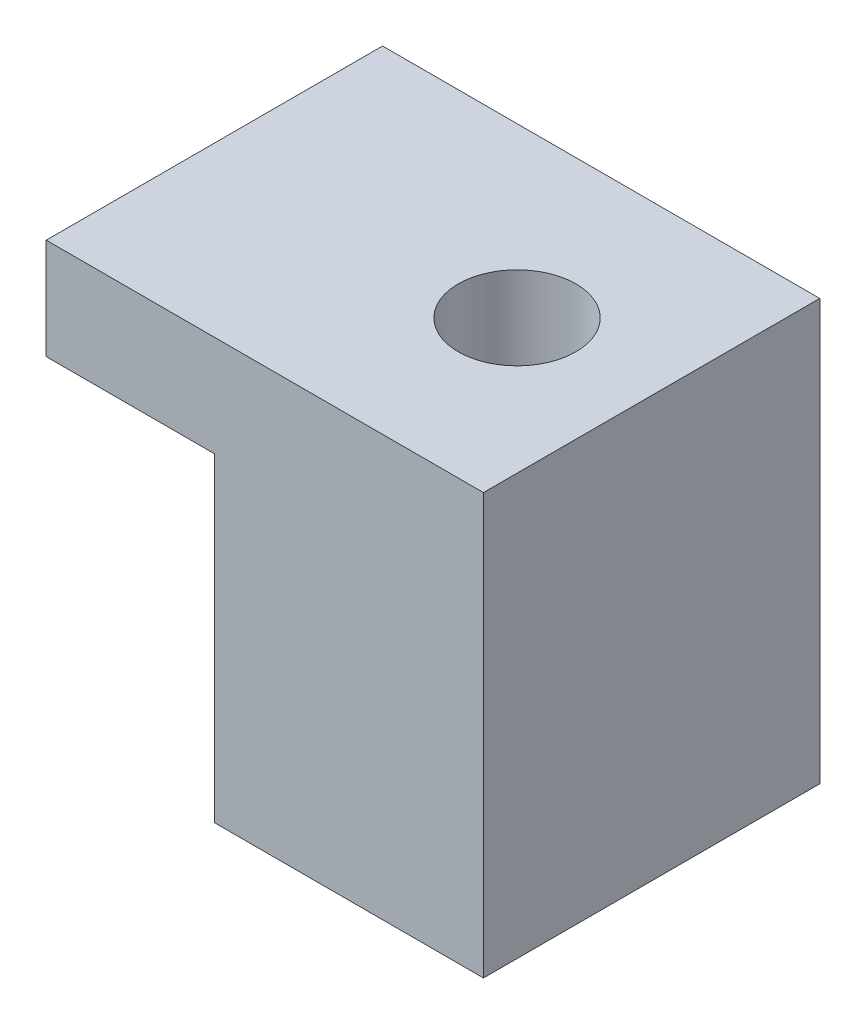
ISO-10303-21;
HEADER;
FILE_DESCRIPTION(('STEP AP214'),'2;1');
FILE_NAME('part.step','',(''),(''),'','','');
FILE_SCHEMA(('AUTOMOTIVE_DESIGN { 1 0 10303 214 1 1 1 1 }'));
ENDSEC;
DATA;
#1=APPLICATION_CONTEXT('core data for automotive mechanical design processes');
#2=APPLICATION_PROTOCOL_DEFINITION('international standard','automotive_design',2000,#1);
#3=PRODUCT_CONTEXT('',#1,'mechanical');
#4=PRODUCT('Part','Part','',(#3));
#5=PRODUCT_RELATED_PRODUCT_CATEGORY('part','',(#4));
#6=PRODUCT_DEFINITION_FORMATION('','',#4);
#7=PRODUCT_DEFINITION_CONTEXT('part definition',#1,'design');
#8=PRODUCT_DEFINITION('design','',#6,#7);
#9=PRODUCT_DEFINITION_SHAPE('','',#8);
#10=(LENGTH_UNIT() NAMED_UNIT(*) SI_UNIT(.MILLI.,.METRE.));
#11=(NAMED_UNIT(*) PLANE_ANGLE_UNIT() SI_UNIT($,.RADIAN.));
#12=(NAMED_UNIT(*) SI_UNIT($,.STERADIAN.) SOLID_ANGLE_UNIT());
#13=UNCERTAINTY_MEASURE_WITH_UNIT(LENGTH_MEASURE(1.E-05),#10,'distance_accuracy_value','');
#14=(GEOMETRIC_REPRESENTATION_CONTEXT(3) GLOBAL_UNCERTAINTY_ASSIGNED_CONTEXT((#13)) GLOBAL_UNIT_ASSIGNED_CONTEXT((#10,
#11,#12)) REPRESENTATION_CONTEXT('',''));
#15=CARTESIAN_POINT('',(0.,0.,0.));
#16=DIRECTION('',(0.,0.,1.));
#17=DIRECTION('',(1.,0.,0.));
#18=AXIS2_PLACEMENT_3D('',#15,#16,#17);
#19=CARTESIAN_POINT('',(8.,0.,10.));
#20=DIRECTION('',(0.,1.,0.));
#21=DIRECTION('',(0.,0.,1.));
#22=AXIS2_PLACEMENT_3D('',#19,#20,#21);
#23=PLANE('',#22);
#24=CARTESIAN_POINT('',(4.,0.,5.));
#25=DIRECTION('',(0.,-1.,0.));
#26=DIRECTION('',(0.,0.,-1.));
#27=AXIS2_PLACEMENT_3D('',#24,#25,#26);
#28=CIRCLE('',#27,1.75);
#29=CARTESIAN_POINT('',(4.,0.,3.25));
#30=VERTEX_POINT('',#29);
#31=EDGE_CURVE('E159',#30,#30,#28,.T.);
#32=ORIENTED_EDGE('',*,*,#31,.F.);
#33=EDGE_LOOP('',(#32));
#34=FACE_BOUND('',#33,.T.);
#35=DIRECTION('',(1.,0.,0.));
#36=VECTOR('',#35,1.);
#37=CARTESIAN_POINT('',(8.,0.,0.));
#38=LINE('',#37,#36);
#39=CARTESIAN_POINT('',(0.,0.,0.));
#40=VERTEX_POINT('',#39);
#41=CARTESIAN_POINT('',(8.,0.,0.));
#42=VERTEX_POINT('',#41);
#43=EDGE_CURVE('E117',#40,#42,#38,.T.);
#44=ORIENTED_EDGE('',*,*,#43,.T.);
#45=DIRECTION('',(0.,0.,-1.));
#46=VECTOR('',#45,1.);
#47=CARTESIAN_POINT('',(8.,0.,10.));
#48=LINE('',#47,#46);
#49=CARTESIAN_POINT('',(8.,0.,10.));
#50=VERTEX_POINT('',#49);
#51=EDGE_CURVE('E11',#50,#42,#48,.T.);
#52=ORIENTED_EDGE('',*,*,#51,.F.);
#53=DIRECTION('',(1.,0.,0.));
#54=VECTOR('',#53,1.);
#55=CARTESIAN_POINT('',(8.,0.,10.));
#56=LINE('',#55,#54);
#57=CARTESIAN_POINT('',(0.,0.,10.));
#58=VERTEX_POINT('',#57);
#59=EDGE_CURVE('E128',#58,#50,#56,.T.);
#60=ORIENTED_EDGE('',*,*,#59,.F.);
#61=DIRECTION('',(0.,0.,-1.));
#62=VECTOR('',#61,1.);
#63=CARTESIAN_POINT('',(0.,0.,10.));
#64=LINE('',#63,#62);
#65=EDGE_CURVE('E113',#58,#40,#64,.T.);
#66=ORIENTED_EDGE('',*,*,#65,.T.);
#67=EDGE_LOOP('',(#44,#52,#60,#66));
#68=FACE_BOUND('',#67,.T.);
#69=ADVANCED_FACE('F33',(#34,#68),#23,.F.);
#70=CARTESIAN_POINT('',(8.,12.5,10.));
#71=DIRECTION('',(-1.,0.,0.));
#72=DIRECTION('',(0.,-1.,0.));
#73=AXIS2_PLACEMENT_3D('',#70,#71,#72);
#74=PLANE('',#73);
#75=DIRECTION('',(0.,1.,0.));
#76=VECTOR('',#75,1.);
#77=CARTESIAN_POINT('',(8.,12.5,0.));
#78=LINE('',#77,#76);
#79=CARTESIAN_POINT('',(8.,12.5,0.));
#80=VERTEX_POINT('',#79);
#81=EDGE_CURVE('E120',#42,#80,#78,.T.);
#82=ORIENTED_EDGE('',*,*,#81,.T.);
#83=DIRECTION('',(0.,0.,-1.));
#84=VECTOR('',#83,1.);
#85=CARTESIAN_POINT('',(8.,12.5,10.));
#86=LINE('',#85,#84);
#87=CARTESIAN_POINT('',(8.,12.5,10.));
#88=VERTEX_POINT('',#87);
#89=EDGE_CURVE('E41',#88,#80,#86,.T.);
#90=ORIENTED_EDGE('',*,*,#89,.F.);
#91=DIRECTION('',(0.,1.,0.));
#92=VECTOR('',#91,1.);
#93=CARTESIAN_POINT('',(8.,12.5,10.));
#94=LINE('',#93,#92);
#95=EDGE_CURVE('E86',#50,#88,#94,.T.);
#96=ORIENTED_EDGE('',*,*,#95,.F.);
#97=ORIENTED_EDGE('',*,*,#51,.T.);
#98=EDGE_LOOP('',(#82,#90,#96,#97));
#99=FACE_BOUND('',#98,.T.);
#100=ADVANCED_FACE('F152',(#99),#74,.F.);
#101=CARTESIAN_POINT('',(-5.,12.5,10.));
#102=DIRECTION('',(0.,-1.,0.));
#103=DIRECTION('',(1.,0.,0.));
#104=AXIS2_PLACEMENT_3D('',#101,#102,#103);
#105=PLANE('',#104);
#106=CARTESIAN_POINT('',(4.,12.5,5.));
#107=DIRECTION('',(0.,-1.,0.));
#108=DIRECTION('',(0.,0.,-1.));
#109=AXIS2_PLACEMENT_3D('',#106,#107,#108);
#110=CIRCLE('',#109,1.75);
#111=CARTESIAN_POINT('',(4.,12.5,3.25));
#112=VERTEX_POINT('',#111);
#113=EDGE_CURVE('E121',#112,#112,#110,.T.);
#114=ORIENTED_EDGE('',*,*,#113,.T.);
#115=EDGE_LOOP('',(#114));
#116=FACE_BOUND('',#115,.T.);
#117=DIRECTION('',(-1.,0.,0.));
#118=VECTOR('',#117,1.);
#119=CARTESIAN_POINT('',(-5.,12.5,0.));
#120=LINE('',#119,#118);
#121=CARTESIAN_POINT('',(-5.,12.5,0.));
#122=VERTEX_POINT('',#121);
#123=EDGE_CURVE('E123',#80,#122,#120,.T.);
#124=ORIENTED_EDGE('',*,*,#123,.T.);
#125=DIRECTION('',(0.,0.,-1.));
#126=VECTOR('',#125,1.);
#127=CARTESIAN_POINT('',(-5.,12.5,10.));
#128=LINE('',#127,#126);
#129=CARTESIAN_POINT('',(-5.,12.5,10.));
#130=VERTEX_POINT('',#129);
#131=EDGE_CURVE('E108',#130,#122,#128,.T.);
#132=ORIENTED_EDGE('',*,*,#131,.F.);
#133=DIRECTION('',(-1.,0.,0.));
#134=VECTOR('',#133,1.);
#135=CARTESIAN_POINT('',(-5.,12.5,10.));
#136=LINE('',#135,#134);
#137=EDGE_CURVE('E99',#88,#130,#136,.T.);
#138=ORIENTED_EDGE('',*,*,#137,.F.);
#139=ORIENTED_EDGE('',*,*,#89,.T.);
#140=EDGE_LOOP('',(#124,#132,#138,#139));
#141=FACE_BOUND('',#140,.T.);
#142=ADVANCED_FACE('F134',(#116,#141),#105,.F.);
#143=CARTESIAN_POINT('',(-5.,9.5,10.));
#144=DIRECTION('',(1.,0.,0.));
#145=DIRECTION('',(0.,0.,-1.));
#146=AXIS2_PLACEMENT_3D('',#143,#144,#145);
#147=PLANE('',#146);
#148=DIRECTION('',(0.,-1.,0.));
#149=VECTOR('',#148,1.);
#150=CARTESIAN_POINT('',(-5.,9.5,0.));
#151=LINE('',#150,#149);
#152=CARTESIAN_POINT('',(-5.,9.5,0.));
#153=VERTEX_POINT('',#152);
#154=EDGE_CURVE('E107',#122,#153,#151,.T.);
#155=ORIENTED_EDGE('',*,*,#154,.T.);
#156=DIRECTION('',(0.,0.,-1.));
#157=VECTOR('',#156,1.);
#158=CARTESIAN_POINT('',(-5.,9.5,10.));
#159=LINE('',#158,#157);
#160=CARTESIAN_POINT('',(-5.,9.5,10.));
#161=VERTEX_POINT('',#160);
#162=EDGE_CURVE('E104',#161,#153,#159,.T.);
#163=ORIENTED_EDGE('',*,*,#162,.F.);
#164=DIRECTION('',(0.,-1.,0.));
#165=VECTOR('',#164,1.);
#166=CARTESIAN_POINT('',(-5.,9.5,10.));
#167=LINE('',#166,#165);
#168=EDGE_CURVE('E93',#130,#161,#167,.T.);
#169=ORIENTED_EDGE('',*,*,#168,.F.);
#170=ORIENTED_EDGE('',*,*,#131,.T.);
#171=EDGE_LOOP('',(#155,#163,#169,#170));
#172=FACE_BOUND('',#171,.T.);
#173=ADVANCED_FACE('F105',(#172),#147,.F.);
#174=CARTESIAN_POINT('',(0.,9.49999999999999,10.));
#175=DIRECTION('',(0.,1.,0.));
#176=DIRECTION('',(-1.,0.,0.));
#177=AXIS2_PLACEMENT_3D('',#174,#175,#176);
#178=PLANE('',#177);
#179=DIRECTION('',(1.,0.,0.));
#180=VECTOR('',#179,1.);
#181=CARTESIAN_POINT('',(0.,9.49999999999999,0.));
#182=LINE('',#181,#180);
#183=CARTESIAN_POINT('',(0.,9.49999999999999,0.));
#184=VERTEX_POINT('',#183);
#185=EDGE_CURVE('E72',#153,#184,#182,.T.);
#186=ORIENTED_EDGE('',*,*,#185,.T.);
#187=DIRECTION('',(0.,0.,-1.));
#188=VECTOR('',#187,1.);
#189=CARTESIAN_POINT('',(0.,9.49999999999999,10.));
#190=LINE('',#189,#188);
#191=CARTESIAN_POINT('',(0.,9.49999999999999,10.));
#192=VERTEX_POINT('',#191);
#193=EDGE_CURVE('E109',#192,#184,#190,.T.);
#194=ORIENTED_EDGE('',*,*,#193,.F.);
#195=DIRECTION('',(1.,0.,0.));
#196=VECTOR('',#195,1.);
#197=CARTESIAN_POINT('',(0.,9.49999999999999,10.));
#198=LINE('',#197,#196);
#199=EDGE_CURVE('E97',#161,#192,#198,.T.);
#200=ORIENTED_EDGE('',*,*,#199,.F.);
#201=ORIENTED_EDGE('',*,*,#162,.T.);
#202=EDGE_LOOP('',(#186,#194,#200,#201));
#203=FACE_BOUND('',#202,.T.);
#204=ADVANCED_FACE('F111',(#203),#178,.F.);
#205=CARTESIAN_POINT('',(0.,0.,10.));
#206=DIRECTION('',(1.,0.,0.));
#207=DIRECTION('',(0.,0.,-1.));
#208=AXIS2_PLACEMENT_3D('',#205,#206,#207);
#209=PLANE('',#208);
#210=DIRECTION('',(0.,-1.,0.));
#211=VECTOR('',#210,1.);
#212=CARTESIAN_POINT('',(0.,0.,0.));
#213=LINE('',#212,#211);
#214=EDGE_CURVE('E78',#184,#40,#213,.T.);
#215=ORIENTED_EDGE('',*,*,#214,.T.);
#216=ORIENTED_EDGE('',*,*,#65,.F.);
#217=DIRECTION('',(0.,-1.,0.));
#218=VECTOR('',#217,1.);
#219=CARTESIAN_POINT('',(0.,0.,10.));
#220=LINE('',#219,#218);
#221=EDGE_CURVE('E49',#192,#58,#220,.T.);
#222=ORIENTED_EDGE('',*,*,#221,.F.);
#223=ORIENTED_EDGE('',*,*,#193,.T.);
#224=EDGE_LOOP('',(#215,#216,#222,#223));
#225=FACE_BOUND('',#224,.T.);
#226=ADVANCED_FACE('F141',(#225),#209,.F.);
#227=CARTESIAN_POINT('',(0.,0.,10.));
#228=DIRECTION('',(0.,0.,-1.));
#229=DIRECTION('',(-1.,0.,0.));
#230=AXIS2_PLACEMENT_3D('',#227,#228,#229);
#231=PLANE('',#230);
#232=ORIENTED_EDGE('',*,*,#59,.T.);
#233=ORIENTED_EDGE('',*,*,#95,.T.);
#234=ORIENTED_EDGE('',*,*,#137,.T.);
#235=ORIENTED_EDGE('',*,*,#168,.T.);
#236=ORIENTED_EDGE('',*,*,#199,.T.);
#237=ORIENTED_EDGE('',*,*,#221,.T.);
#238=EDGE_LOOP('',(#232,#233,#234,#235,#236,#237));
#239=FACE_BOUND('',#238,.T.);
#240=ADVANCED_FACE('F95',(#239),#231,.F.);
#241=CARTESIAN_POINT('',(0.,0.,0.));
#242=DIRECTION('',(0.,0.,-1.));
#243=DIRECTION('',(-1.,0.,0.));
#244=AXIS2_PLACEMENT_3D('',#241,#242,#243);
#245=PLANE('',#244);
#246=ORIENTED_EDGE('',*,*,#43,.F.);
#247=ORIENTED_EDGE('',*,*,#214,.F.);
#248=ORIENTED_EDGE('',*,*,#185,.F.);
#249=ORIENTED_EDGE('',*,*,#154,.F.);
#250=ORIENTED_EDGE('',*,*,#123,.F.);
#251=ORIENTED_EDGE('',*,*,#81,.F.);
#252=EDGE_LOOP('',(#246,#247,#248,#249,#250,#251));
#253=FACE_BOUND('',#252,.T.);
#254=ADVANCED_FACE('F137',(#253),#245,.T.);
#255=CARTESIAN_POINT('',(4.,12.5,5.));
#256=DIRECTION('',(0.,-1.,0.));
#257=DIRECTION('',(0.,0.,-1.));
#258=AXIS2_PLACEMENT_3D('',#255,#256,#257);
#259=CYLINDRICAL_SURFACE('',#258,1.75);
#260=ORIENTED_EDGE('',*,*,#113,.F.);
#261=EDGE_LOOP('',(#260));
#262=FACE_BOUND('',#261,.T.);
#263=ORIENTED_EDGE('',*,*,#31,.T.);
#264=EDGE_LOOP('',(#263));
#265=FACE_BOUND('',#264,.T.);
#266=ADVANCED_FACE('F169',(#262,#265),#259,.F.);
#267=CLOSED_SHELL('',(#69,#100,#142,#173,#204,#226,#240,#254,#266));
#268=MANIFOLD_SOLID_BREP('B2',#267);
#269=ADVANCED_BREP_SHAPE_REPRESENTATION('',(#18,#268),#14);
#270=SHAPE_DEFINITION_REPRESENTATION(#9,#269);
ENDSEC;
END-ISO-10303-21;
